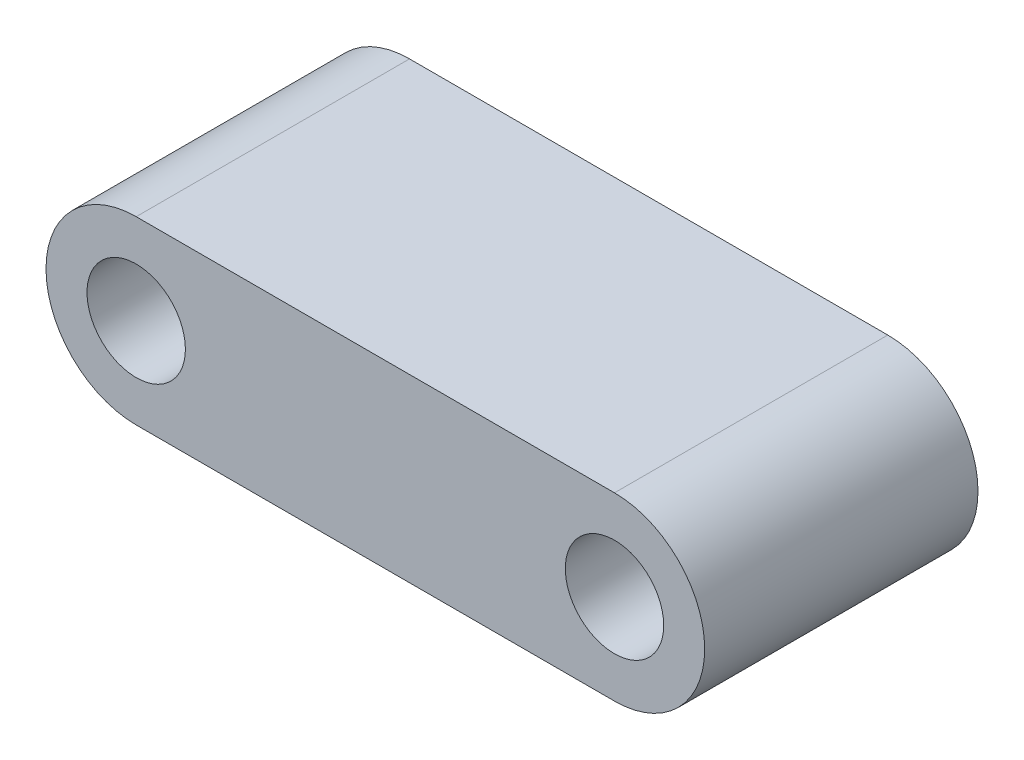
ISO-10303-21;
HEADER;
FILE_DESCRIPTION(('STEP AP214'),'2;1');
FILE_NAME('part.step','',(''),(''),'','','');
FILE_SCHEMA(('AUTOMOTIVE_DESIGN { 1 0 10303 214 1 1 1 1 }'));
ENDSEC;
DATA;
#1=APPLICATION_CONTEXT('core data for automotive mechanical design processes');
#2=APPLICATION_PROTOCOL_DEFINITION('international standard','automotive_design',2000,#1);
#3=PRODUCT_CONTEXT('',#1,'mechanical');
#4=PRODUCT('Part','Part','',(#3));
#5=PRODUCT_RELATED_PRODUCT_CATEGORY('part','',(#4));
#6=PRODUCT_DEFINITION_FORMATION('','',#4);
#7=PRODUCT_DEFINITION_CONTEXT('part definition',#1,'design');
#8=PRODUCT_DEFINITION('design','',#6,#7);
#9=PRODUCT_DEFINITION_SHAPE('','',#8);
#10=(LENGTH_UNIT() NAMED_UNIT(*) SI_UNIT(.MILLI.,.METRE.));
#11=(NAMED_UNIT(*) PLANE_ANGLE_UNIT() SI_UNIT($,.RADIAN.));
#12=(NAMED_UNIT(*) SI_UNIT($,.STERADIAN.) SOLID_ANGLE_UNIT());
#13=UNCERTAINTY_MEASURE_WITH_UNIT(LENGTH_MEASURE(1.E-05),#10,'distance_accuracy_value','');
#14=(GEOMETRIC_REPRESENTATION_CONTEXT(3) GLOBAL_UNCERTAINTY_ASSIGNED_CONTEXT((#13)) GLOBAL_UNIT_ASSIGNED_CONTEXT((#10,
#11,#12)) REPRESENTATION_CONTEXT('',''));
#15=CARTESIAN_POINT('',(0.,0.,0.));
#16=DIRECTION('',(0.,0.,1.));
#17=DIRECTION('',(1.,0.,0.));
#18=AXIS2_PLACEMENT_3D('',#15,#16,#17);
#19=CARTESIAN_POINT('',(-7.6,0.,10.));
#20=DIRECTION('',(0.,0.,-1.));
#21=DIRECTION('',(-1.,0.,0.));
#22=AXIS2_PLACEMENT_3D('',#19,#20,#21);
#23=CYLINDRICAL_SURFACE('',#22,3.3);
#24=CARTESIAN_POINT('',(-7.6,0.,0.));
#25=DIRECTION('',(0.,0.,1.));
#26=DIRECTION('',(1.,0.,0.));
#27=AXIS2_PLACEMENT_3D('',#24,#25,#26);
#28=CIRCLE('',#27,3.3);
#29=CARTESIAN_POINT('',(-7.6,3.3,0.));
#30=VERTEX_POINT('',#29);
#31=CARTESIAN_POINT('',(-7.6,-3.3,0.));
#32=VERTEX_POINT('',#31);
#33=EDGE_CURVE('E96',#30,#32,#28,.T.);
#34=ORIENTED_EDGE('',*,*,#33,.T.);
#35=DIRECTION('',(0.,0.,-1.));
#36=VECTOR('',#35,1.);
#37=CARTESIAN_POINT('',(-7.6,-3.3,10.));
#38=LINE('',#37,#36);
#39=CARTESIAN_POINT('',(-7.6,-3.3,10.));
#40=VERTEX_POINT('',#39);
#41=EDGE_CURVE('E11',#40,#32,#38,.T.);
#42=ORIENTED_EDGE('',*,*,#41,.F.);
#43=CARTESIAN_POINT('',(-7.6,0.,10.));
#44=DIRECTION('',(0.,0.,1.));
#45=DIRECTION('',(1.,0.,0.));
#46=AXIS2_PLACEMENT_3D('',#43,#44,#45);
#47=CIRCLE('',#46,3.3);
#48=CARTESIAN_POINT('',(-7.6,3.3,10.));
#49=VERTEX_POINT('',#48);
#50=EDGE_CURVE('E84',#49,#40,#47,.T.);
#51=ORIENTED_EDGE('',*,*,#50,.F.);
#52=DIRECTION('',(0.,0.,-1.));
#53=VECTOR('',#52,1.);
#54=CARTESIAN_POINT('',(-7.6,3.3,10.));
#55=LINE('',#54,#53);
#56=EDGE_CURVE('E92',#49,#30,#55,.T.);
#57=ORIENTED_EDGE('',*,*,#56,.T.);
#58=EDGE_LOOP('',(#34,#42,#51,#57));
#59=FACE_BOUND('',#58,.T.);
#60=ADVANCED_FACE('F33',(#59),#23,.T.);
#61=CARTESIAN_POINT('',(-7.6,-3.3,10.));
#62=DIRECTION('',(0.,1.,0.));
#63=DIRECTION('',(0.,0.,1.));
#64=AXIS2_PLACEMENT_3D('',#61,#62,#63);
#65=PLANE('',#64);
#66=DIRECTION('',(1.,0.,0.));
#67=VECTOR('',#66,1.);
#68=CARTESIAN_POINT('',(-7.6,-3.3,0.));
#69=LINE('',#68,#67);
#70=CARTESIAN_POINT('',(9.9,-3.3,0.));
#71=VERTEX_POINT('',#70);
#72=EDGE_CURVE('E88',#32,#71,#69,.T.);
#73=ORIENTED_EDGE('',*,*,#72,.T.);
#74=DIRECTION('',(0.,0.,-1.));
#75=VECTOR('',#74,1.);
#76=CARTESIAN_POINT('',(9.9,-3.3,10.));
#77=LINE('',#76,#75);
#78=CARTESIAN_POINT('',(9.9,-3.3,10.));
#79=VERTEX_POINT('',#78);
#80=EDGE_CURVE('E41',#79,#71,#77,.T.);
#81=ORIENTED_EDGE('',*,*,#80,.F.);
#82=DIRECTION('',(1.,0.,0.));
#83=VECTOR('',#82,1.);
#84=CARTESIAN_POINT('',(-7.6,-3.3,10.));
#85=LINE('',#84,#83);
#86=EDGE_CURVE('E79',#40,#79,#85,.T.);
#87=ORIENTED_EDGE('',*,*,#86,.F.);
#88=ORIENTED_EDGE('',*,*,#41,.T.);
#89=EDGE_LOOP('',(#73,#81,#87,#88));
#90=FACE_BOUND('',#89,.T.);
#91=ADVANCED_FACE('F87',(#90),#65,.F.);
#92=CARTESIAN_POINT('',(9.9,0.,10.));
#93=DIRECTION('',(0.,0.,-1.));
#94=DIRECTION('',(-1.,0.,0.));
#95=AXIS2_PLACEMENT_3D('',#92,#93,#94);
#96=CYLINDRICAL_SURFACE('',#95,3.3);
#97=CARTESIAN_POINT('',(9.9,0.,0.));
#98=DIRECTION('',(0.,0.,1.));
#99=DIRECTION('',(1.,0.,0.));
#100=AXIS2_PLACEMENT_3D('',#97,#98,#99);
#101=CIRCLE('',#100,3.3);
#102=CARTESIAN_POINT('',(9.9,3.3,0.));
#103=VERTEX_POINT('',#102);
#104=EDGE_CURVE('E66',#71,#103,#101,.T.);
#105=ORIENTED_EDGE('',*,*,#104,.T.);
#106=DIRECTION('',(0.,0.,-1.));
#107=VECTOR('',#106,1.);
#108=CARTESIAN_POINT('',(9.9,3.3,10.));
#109=LINE('',#108,#107);
#110=CARTESIAN_POINT('',(9.9,3.3,10.));
#111=VERTEX_POINT('',#110);
#112=EDGE_CURVE('E89',#111,#103,#109,.T.);
#113=ORIENTED_EDGE('',*,*,#112,.F.);
#114=CARTESIAN_POINT('',(9.9,0.,10.));
#115=DIRECTION('',(0.,0.,1.));
#116=DIRECTION('',(1.,0.,0.));
#117=AXIS2_PLACEMENT_3D('',#114,#115,#116);
#118=CIRCLE('',#117,3.3);
#119=EDGE_CURVE('E82',#79,#111,#118,.T.);
#120=ORIENTED_EDGE('',*,*,#119,.F.);
#121=ORIENTED_EDGE('',*,*,#80,.T.);
#122=EDGE_LOOP('',(#105,#113,#120,#121));
#123=FACE_BOUND('',#122,.T.);
#124=ADVANCED_FACE('F90',(#123),#96,.T.);
#125=CARTESIAN_POINT('',(-7.6,3.3,10.));
#126=DIRECTION('',(0.,-1.,0.));
#127=DIRECTION('',(0.,0.,-1.));
#128=AXIS2_PLACEMENT_3D('',#125,#126,#127);
#129=PLANE('',#128);
#130=DIRECTION('',(-1.,0.,0.));
#131=VECTOR('',#130,1.);
#132=CARTESIAN_POINT('',(-7.6,3.3,0.));
#133=LINE('',#132,#131);
#134=EDGE_CURVE('E72',#103,#30,#133,.T.);
#135=ORIENTED_EDGE('',*,*,#134,.T.);
#136=ORIENTED_EDGE('',*,*,#56,.F.);
#137=DIRECTION('',(-1.,0.,0.));
#138=VECTOR('',#137,1.);
#139=CARTESIAN_POINT('',(-7.6,3.3,10.));
#140=LINE('',#139,#138);
#141=EDGE_CURVE('E49',#111,#49,#140,.T.);
#142=ORIENTED_EDGE('',*,*,#141,.F.);
#143=ORIENTED_EDGE('',*,*,#112,.T.);
#144=EDGE_LOOP('',(#135,#136,#142,#143));
#145=FACE_BOUND('',#144,.T.);
#146=ADVANCED_FACE('F104',(#145),#129,.F.);
#147=CARTESIAN_POINT('',(-7.6,0.,10.));
#148=DIRECTION('',(0.,0.,1.));
#149=DIRECTION('',(1.,0.,0.));
#150=AXIS2_PLACEMENT_3D('',#147,#148,#149);
#151=PLANE('',#150);
#152=CARTESIAN_POINT('',(-7.6,0.,10.));
#153=DIRECTION('',(0.,0.,1.));
#154=DIRECTION('',(1.,0.,0.));
#155=AXIS2_PLACEMENT_3D('',#152,#153,#154);
#156=CIRCLE('',#155,1.8);
#157=CARTESIAN_POINT('',(-5.8,0.,10.));
#158=VERTEX_POINT('',#157);
#159=EDGE_CURVE('E118',#158,#158,#156,.T.);
#160=ORIENTED_EDGE('',*,*,#159,.F.);
#161=EDGE_LOOP('',(#160));
#162=FACE_BOUND('',#161,.T.);
#163=CARTESIAN_POINT('',(9.9,0.,10.));
#164=DIRECTION('',(0.,0.,1.));
#165=DIRECTION('',(1.,0.,0.));
#166=AXIS2_PLACEMENT_3D('',#163,#164,#165);
#167=CIRCLE('',#166,1.8);
#168=CARTESIAN_POINT('',(11.7,0.,10.));
#169=VERTEX_POINT('',#168);
#170=EDGE_CURVE('E112',#169,#169,#167,.T.);
#171=ORIENTED_EDGE('',*,*,#170,.F.);
#172=EDGE_LOOP('',(#171));
#173=FACE_BOUND('',#172,.T.);
#174=ORIENTED_EDGE('',*,*,#50,.T.);
#175=ORIENTED_EDGE('',*,*,#86,.T.);
#176=ORIENTED_EDGE('',*,*,#119,.T.);
#177=ORIENTED_EDGE('',*,*,#141,.T.);
#178=EDGE_LOOP('',(#174,#175,#176,#177));
#179=FACE_BOUND('',#178,.T.);
#180=ADVANCED_FACE('F80',(#162,#173,#179),#151,.T.);
#181=CARTESIAN_POINT('',(-7.6,0.,0.));
#182=DIRECTION('',(0.,0.,1.));
#183=DIRECTION('',(1.,0.,0.));
#184=AXIS2_PLACEMENT_3D('',#181,#182,#183);
#185=PLANE('',#184);
#186=CARTESIAN_POINT('',(-7.6,0.,0.));
#187=DIRECTION('',(0.,0.,1.));
#188=DIRECTION('',(1.,0.,0.));
#189=AXIS2_PLACEMENT_3D('',#186,#187,#188);
#190=CIRCLE('',#189,1.8);
#191=CARTESIAN_POINT('',(-5.8,0.,0.));
#192=VERTEX_POINT('',#191);
#193=EDGE_CURVE('E115',#192,#192,#190,.T.);
#194=ORIENTED_EDGE('',*,*,#193,.T.);
#195=EDGE_LOOP('',(#194));
#196=FACE_BOUND('',#195,.T.);
#197=CARTESIAN_POINT('',(9.9,0.,0.));
#198=DIRECTION('',(0.,0.,1.));
#199=DIRECTION('',(1.,0.,0.));
#200=AXIS2_PLACEMENT_3D('',#197,#198,#199);
#201=CIRCLE('',#200,1.8);
#202=CARTESIAN_POINT('',(11.7,0.,0.));
#203=VERTEX_POINT('',#202);
#204=EDGE_CURVE('E99',#203,#203,#201,.T.);
#205=ORIENTED_EDGE('',*,*,#204,.T.);
#206=EDGE_LOOP('',(#205));
#207=FACE_BOUND('',#206,.T.);
#208=ORIENTED_EDGE('',*,*,#33,.F.);
#209=ORIENTED_EDGE('',*,*,#134,.F.);
#210=ORIENTED_EDGE('',*,*,#104,.F.);
#211=ORIENTED_EDGE('',*,*,#72,.F.);
#212=EDGE_LOOP('',(#208,#209,#210,#211));
#213=FACE_BOUND('',#212,.T.);
#214=ADVANCED_FACE('F107',(#196,#207,#213),#185,.F.);
#215=CARTESIAN_POINT('',(9.9,0.,10.));
#216=DIRECTION('',(0.,0.,1.));
#217=DIRECTION('',(1.,0.,0.));
#218=AXIS2_PLACEMENT_3D('',#215,#216,#217);
#219=CYLINDRICAL_SURFACE('',#218,1.8);
#220=ORIENTED_EDGE('',*,*,#204,.F.);
#221=EDGE_LOOP('',(#220));
#222=FACE_BOUND('',#221,.T.);
#223=ORIENTED_EDGE('',*,*,#170,.T.);
#224=EDGE_LOOP('',(#223));
#225=FACE_BOUND('',#224,.T.);
#226=ADVANCED_FACE('F129',(#222,#225),#219,.F.);
#227=CARTESIAN_POINT('',(-7.6,0.,10.));
#228=DIRECTION('',(0.,0.,1.));
#229=DIRECTION('',(1.,0.,0.));
#230=AXIS2_PLACEMENT_3D('',#227,#228,#229);
#231=CYLINDRICAL_SURFACE('',#230,1.8);
#232=ORIENTED_EDGE('',*,*,#193,.F.);
#233=EDGE_LOOP('',(#232));
#234=FACE_BOUND('',#233,.T.);
#235=ORIENTED_EDGE('',*,*,#159,.T.);
#236=EDGE_LOOP('',(#235));
#237=FACE_BOUND('',#236,.T.);
#238=ADVANCED_FACE('F122',(#234,#237),#231,.F.);
#239=CLOSED_SHELL('',(#60,#91,#124,#146,#180,#214,#226,#238));
#240=MANIFOLD_SOLID_BREP('B2',#239);
#241=ADVANCED_BREP_SHAPE_REPRESENTATION('',(#18,#240),#14);
#242=SHAPE_DEFINITION_REPRESENTATION(#9,#241);
ENDSEC;
END-ISO-10303-21;
